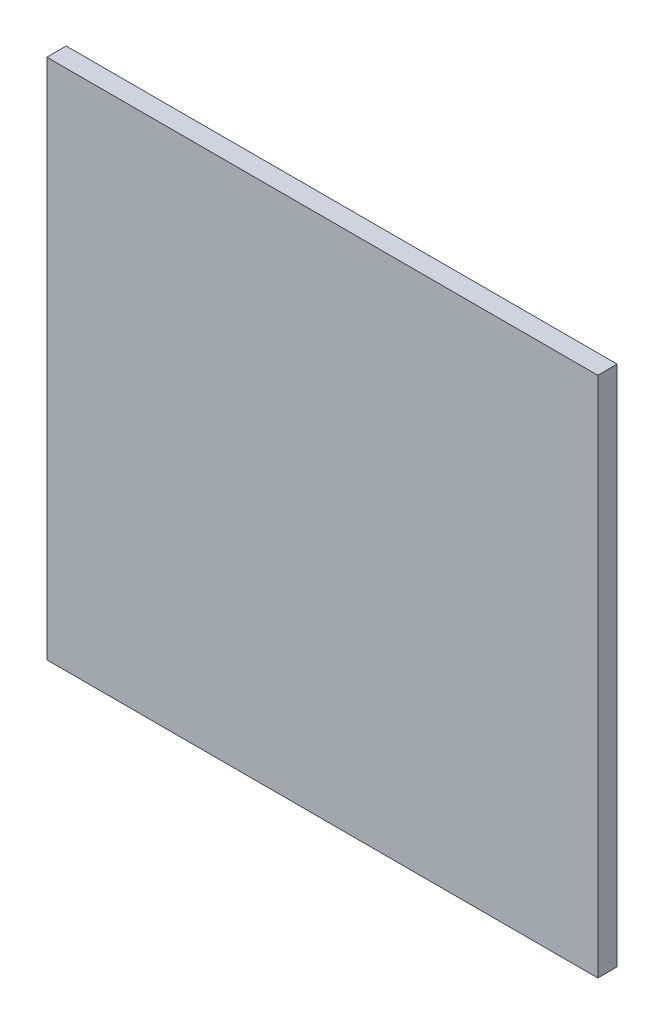
ISO-10303-21;
HEADER;
FILE_DESCRIPTION(('STEP AP214'),'2;1');
FILE_NAME('part.step','',(''),(''),'','','');
FILE_SCHEMA(('AUTOMOTIVE_DESIGN { 1 0 10303 214 1 1 1 1 }'));
ENDSEC;
DATA;
#1=APPLICATION_CONTEXT('core data for automotive mechanical design processes');
#2=APPLICATION_PROTOCOL_DEFINITION('international standard','automotive_design',2000,#1);
#3=PRODUCT_CONTEXT('',#1,'mechanical');
#4=PRODUCT('Part','Part','',(#3));
#5=PRODUCT_RELATED_PRODUCT_CATEGORY('part','',(#4));
#6=PRODUCT_DEFINITION_FORMATION('','',#4);
#7=PRODUCT_DEFINITION_CONTEXT('part definition',#1,'design');
#8=PRODUCT_DEFINITION('design','',#6,#7);
#9=PRODUCT_DEFINITION_SHAPE('','',#8);
#10=(LENGTH_UNIT() NAMED_UNIT(*) SI_UNIT(.MILLI.,.METRE.));
#11=(NAMED_UNIT(*) PLANE_ANGLE_UNIT() SI_UNIT($,.RADIAN.));
#12=(NAMED_UNIT(*) SI_UNIT($,.STERADIAN.) SOLID_ANGLE_UNIT());
#13=UNCERTAINTY_MEASURE_WITH_UNIT(LENGTH_MEASURE(1.E-05),#10,'distance_accuracy_value','');
#14=(GEOMETRIC_REPRESENTATION_CONTEXT(3) GLOBAL_UNCERTAINTY_ASSIGNED_CONTEXT((#13)) GLOBAL_UNIT_ASSIGNED_CONTEXT((#10,
#11,#12)) REPRESENTATION_CONTEXT('',''));
#15=CARTESIAN_POINT('',(0.,0.,0.));
#16=DIRECTION('',(0.,0.,1.));
#17=DIRECTION('',(1.,0.,0.));
#18=AXIS2_PLACEMENT_3D('',#15,#16,#17);
#19=CARTESIAN_POINT('',(45.24375,42.8625,3.175));
#20=DIRECTION('',(-1.,0.,0.));
#21=DIRECTION('',(0.,-1.,0.));
#22=AXIS2_PLACEMENT_3D('',#19,#20,#21);
#23=PLANE('',#22);
#24=DIRECTION('',(0.,1.,0.));
#25=VECTOR('',#24,1.);
#26=CARTESIAN_POINT('',(45.24375,42.8625,0.));
#27=LINE('',#26,#25);
#28=CARTESIAN_POINT('',(45.24375,-42.8625,0.));
#29=VERTEX_POINT('',#28);
#30=CARTESIAN_POINT('',(45.24375,42.8625,0.));
#31=VERTEX_POINT('',#30);
#32=EDGE_CURVE('E96',#29,#31,#27,.T.);
#33=ORIENTED_EDGE('',*,*,#32,.T.);
#34=DIRECTION('',(0.,0.,-1.));
#35=VECTOR('',#34,1.);
#36=CARTESIAN_POINT('',(45.24375,42.8625,3.175));
#37=LINE('',#36,#35);
#38=CARTESIAN_POINT('',(45.24375,42.8625,3.175));
#39=VERTEX_POINT('',#38);
#40=EDGE_CURVE('E11',#39,#31,#37,.T.);
#41=ORIENTED_EDGE('',*,*,#40,.F.);
#42=DIRECTION('',(0.,1.,0.));
#43=VECTOR('',#42,1.);
#44=CARTESIAN_POINT('',(45.24375,42.8625,3.175));
#45=LINE('',#44,#43);
#46=CARTESIAN_POINT('',(45.24375,-42.8625,3.175));
#47=VERTEX_POINT('',#46);
#48=EDGE_CURVE('E84',#47,#39,#45,.T.);
#49=ORIENTED_EDGE('',*,*,#48,.F.);
#50=DIRECTION('',(0.,0.,-1.));
#51=VECTOR('',#50,1.);
#52=CARTESIAN_POINT('',(45.24375,-42.8625,3.175));
#53=LINE('',#52,#51);
#54=EDGE_CURVE('E92',#47,#29,#53,.T.);
#55=ORIENTED_EDGE('',*,*,#54,.T.);
#56=EDGE_LOOP('',(#33,#41,#49,#55));
#57=FACE_BOUND('',#56,.T.);
#58=ADVANCED_FACE('F33',(#57),#23,.F.);
#59=CARTESIAN_POINT('',(-45.24375,42.8625,3.175));
#60=DIRECTION('',(0.,-1.,0.));
#61=DIRECTION('',(0.,0.,-1.));
#62=AXIS2_PLACEMENT_3D('',#59,#60,#61);
#63=PLANE('',#62);
#64=DIRECTION('',(-1.,0.,0.));
#65=VECTOR('',#64,1.);
#66=CARTESIAN_POINT('',(-45.24375,42.8625,0.));
#67=LINE('',#66,#65);
#68=CARTESIAN_POINT('',(-45.24375,42.8625,0.));
#69=VERTEX_POINT('',#68);
#70=EDGE_CURVE('E88',#31,#69,#67,.T.);
#71=ORIENTED_EDGE('',*,*,#70,.T.);
#72=DIRECTION('',(0.,0.,-1.));
#73=VECTOR('',#72,1.);
#74=CARTESIAN_POINT('',(-45.24375,42.8625,3.175));
#75=LINE('',#74,#73);
#76=CARTESIAN_POINT('',(-45.24375,42.8625,3.175));
#77=VERTEX_POINT('',#76);
#78=EDGE_CURVE('E41',#77,#69,#75,.T.);
#79=ORIENTED_EDGE('',*,*,#78,.F.);
#80=DIRECTION('',(-1.,0.,0.));
#81=VECTOR('',#80,1.);
#82=CARTESIAN_POINT('',(-45.24375,42.8625,3.175));
#83=LINE('',#82,#81);
#84=EDGE_CURVE('E79',#39,#77,#83,.T.);
#85=ORIENTED_EDGE('',*,*,#84,.F.);
#86=ORIENTED_EDGE('',*,*,#40,.T.);
#87=EDGE_LOOP('',(#71,#79,#85,#86));
#88=FACE_BOUND('',#87,.T.);
#89=ADVANCED_FACE('F87',(#88),#63,.F.);
#90=CARTESIAN_POINT('',(-45.24375,42.8625,3.175));
#91=DIRECTION('',(1.,0.,0.));
#92=DIRECTION('',(0.,1.,0.));
#93=AXIS2_PLACEMENT_3D('',#90,#91,#92);
#94=PLANE('',#93);
#95=DIRECTION('',(0.,-1.,0.));
#96=VECTOR('',#95,1.);
#97=CARTESIAN_POINT('',(-45.24375,42.8625,0.));
#98=LINE('',#97,#96);
#99=CARTESIAN_POINT('',(-45.24375,-42.8625,0.));
#100=VERTEX_POINT('',#99);
#101=EDGE_CURVE('E66',#69,#100,#98,.T.);
#102=ORIENTED_EDGE('',*,*,#101,.T.);
#103=DIRECTION('',(0.,0.,-1.));
#104=VECTOR('',#103,1.);
#105=CARTESIAN_POINT('',(-45.24375,-42.8625,3.175));
#106=LINE('',#105,#104);
#107=CARTESIAN_POINT('',(-45.24375,-42.8625,3.175));
#108=VERTEX_POINT('',#107);
#109=EDGE_CURVE('E89',#108,#100,#106,.T.);
#110=ORIENTED_EDGE('',*,*,#109,.F.);
#111=DIRECTION('',(0.,-1.,0.));
#112=VECTOR('',#111,1.);
#113=CARTESIAN_POINT('',(-45.24375,42.8625,3.175));
#114=LINE('',#113,#112);
#115=EDGE_CURVE('E82',#77,#108,#114,.T.);
#116=ORIENTED_EDGE('',*,*,#115,.F.);
#117=ORIENTED_EDGE('',*,*,#78,.T.);
#118=EDGE_LOOP('',(#102,#110,#116,#117));
#119=FACE_BOUND('',#118,.T.);
#120=ADVANCED_FACE('F90',(#119),#94,.F.);
#121=CARTESIAN_POINT('',(-45.24375,-42.8625,3.175));
#122=DIRECTION('',(0.,1.,0.));
#123=DIRECTION('',(0.,0.,1.));
#124=AXIS2_PLACEMENT_3D('',#121,#122,#123);
#125=PLANE('',#124);
#126=DIRECTION('',(1.,0.,0.));
#127=VECTOR('',#126,1.);
#128=CARTESIAN_POINT('',(-45.24375,-42.8625,0.));
#129=LINE('',#128,#127);
#130=EDGE_CURVE('E72',#100,#29,#129,.T.);
#131=ORIENTED_EDGE('',*,*,#130,.T.);
#132=ORIENTED_EDGE('',*,*,#54,.F.);
#133=DIRECTION('',(1.,0.,0.));
#134=VECTOR('',#133,1.);
#135=CARTESIAN_POINT('',(-45.24375,-42.8625,3.175));
#136=LINE('',#135,#134);
#137=EDGE_CURVE('E49',#108,#47,#136,.T.);
#138=ORIENTED_EDGE('',*,*,#137,.F.);
#139=ORIENTED_EDGE('',*,*,#109,.T.);
#140=EDGE_LOOP('',(#131,#132,#138,#139));
#141=FACE_BOUND('',#140,.T.);
#142=ADVANCED_FACE('F103',(#141),#125,.F.);
#143=CARTESIAN_POINT('',(0.,0.,3.175));
#144=DIRECTION('',(0.,0.,1.));
#145=DIRECTION('',(1.,0.,0.));
#146=AXIS2_PLACEMENT_3D('',#143,#144,#145);
#147=PLANE('',#146);
#148=ORIENTED_EDGE('',*,*,#48,.T.);
#149=ORIENTED_EDGE('',*,*,#84,.T.);
#150=ORIENTED_EDGE('',*,*,#115,.T.);
#151=ORIENTED_EDGE('',*,*,#137,.T.);
#152=EDGE_LOOP('',(#148,#149,#150,#151));
#153=FACE_BOUND('',#152,.T.);
#154=ADVANCED_FACE('F80',(#153),#147,.T.);
#155=CARTESIAN_POINT('',(0.,0.,0.));
#156=DIRECTION('',(0.,0.,1.));
#157=DIRECTION('',(1.,0.,0.));
#158=AXIS2_PLACEMENT_3D('',#155,#156,#157);
#159=PLANE('',#158);
#160=ORIENTED_EDGE('',*,*,#32,.F.);
#161=ORIENTED_EDGE('',*,*,#130,.F.);
#162=ORIENTED_EDGE('',*,*,#101,.F.);
#163=ORIENTED_EDGE('',*,*,#70,.F.);
#164=EDGE_LOOP('',(#160,#161,#162,#163));
#165=FACE_BOUND('',#164,.T.);
#166=ADVANCED_FACE('F106',(#165),#159,.F.);
#167=CLOSED_SHELL('',(#58,#89,#120,#142,#154,#166));
#168=MANIFOLD_SOLID_BREP('B2',#167);
#169=ADVANCED_BREP_SHAPE_REPRESENTATION('',(#18,#168),#14);
#170=SHAPE_DEFINITION_REPRESENTATION(#9,#169);
ENDSEC;
END-ISO-10303-21;
